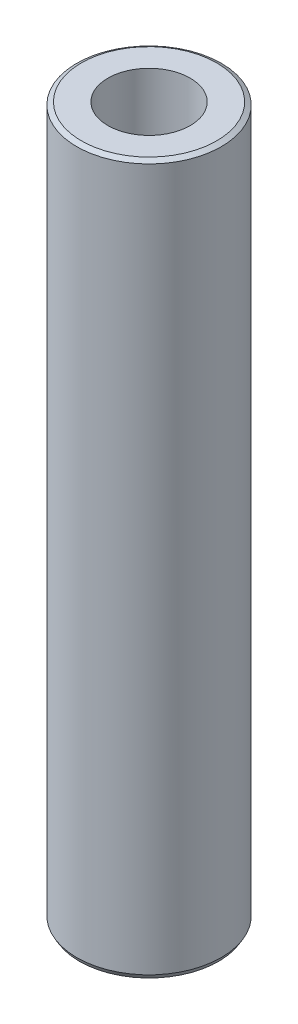
ISO-10303-21;
HEADER;
FILE_DESCRIPTION(('STEP AP214'),'2;1');
FILE_NAME('part.step','',(''),(''),'','','');
FILE_SCHEMA(('AUTOMOTIVE_DESIGN { 1 0 10303 214 1 1 1 1 }'));
ENDSEC;
DATA;
#1=APPLICATION_CONTEXT('core data for automotive mechanical design processes');
#2=APPLICATION_PROTOCOL_DEFINITION('international standard','automotive_design',2000,#1);
#3=PRODUCT_CONTEXT('',#1,'mechanical');
#4=PRODUCT('Part','Part','',(#3));
#5=PRODUCT_RELATED_PRODUCT_CATEGORY('part','',(#4));
#6=PRODUCT_DEFINITION_FORMATION('','',#4);
#7=PRODUCT_DEFINITION_CONTEXT('part definition',#1,'design');
#8=PRODUCT_DEFINITION('design','',#6,#7);
#9=PRODUCT_DEFINITION_SHAPE('','',#8);
#10=(LENGTH_UNIT() NAMED_UNIT(*) SI_UNIT(.MILLI.,.METRE.));
#11=(NAMED_UNIT(*) PLANE_ANGLE_UNIT() SI_UNIT($,.RADIAN.));
#12=(NAMED_UNIT(*) SI_UNIT($,.STERADIAN.) SOLID_ANGLE_UNIT());
#13=UNCERTAINTY_MEASURE_WITH_UNIT(LENGTH_MEASURE(1.E-05),#10,'distance_accuracy_value','');
#14=(GEOMETRIC_REPRESENTATION_CONTEXT(3) GLOBAL_UNCERTAINTY_ASSIGNED_CONTEXT((#13)) GLOBAL_UNIT_ASSIGNED_CONTEXT((#10,
#11,#12)) REPRESENTATION_CONTEXT('',''));
#15=CARTESIAN_POINT('',(0.,0.,0.));
#16=DIRECTION('',(0.,0.,1.));
#17=DIRECTION('',(1.,0.,0.));
#18=AXIS2_PLACEMENT_3D('',#15,#16,#17);
#19=CARTESIAN_POINT('',(0.,490.777688378115,0.));
#20=DIRECTION('',(0.,-1.,0.));
#21=DIRECTION('',(0.,0.,-1.));
#22=AXIS2_PLACEMENT_3D('',#19,#20,#21);
#23=CYLINDRICAL_SURFACE('',#22,50.);
#24=CARTESIAN_POINT('',(0.,488.915262984314,0.));
#25=DIRECTION('',(0.,1.,0.));
#26=DIRECTION('',(0.,0.,1.));
#27=AXIS2_PLACEMENT_3D('',#24,#25,#26);
#28=CIRCLE('',#27,50.);
#29=CARTESIAN_POINT('',(0.,488.915262984314,-50.));
#30=VERTEX_POINT('',#29);
#31=EDGE_CURVE('E50',#30,#30,#28,.F.);
#32=ORIENTED_EDGE('',*,*,#31,.T.);
#33=EDGE_LOOP('',(#32));
#34=FACE_BOUND('',#33,.T.);
#35=CARTESIAN_POINT('',(0.,3.2258154073696,0.));
#36=DIRECTION('',(0.,1.,0.));
#37=DIRECTION('',(0.,0.,1.));
#38=AXIS2_PLACEMENT_3D('',#35,#36,#37);
#39=CIRCLE('',#38,50.);
#40=CARTESIAN_POINT('',(0.,3.2258154073696,50.));
#41=VERTEX_POINT('',#40);
#42=EDGE_CURVE('E51',#41,#41,#39,.T.);
#43=ORIENTED_EDGE('',*,*,#42,.T.);
#44=EDGE_LOOP('',(#43));
#45=FACE_BOUND('',#44,.T.);
#46=ADVANCED_FACE('F39',(#34,#45),#23,.T.);
#47=CARTESIAN_POINT('',(0.,490.777688378115,0.));
#48=DIRECTION('',(0.,1.,0.));
#49=DIRECTION('',(0.,0.,1.));
#50=AXIS2_PLACEMENT_3D('',#47,#48,#49);
#51=PLANE('',#50);
#52=CARTESIAN_POINT('',(0.,490.777688378115,0.));
#53=DIRECTION('',(0.,1.,0.));
#54=DIRECTION('',(0.,0.,1.));
#55=AXIS2_PLACEMENT_3D('',#52,#53,#54);
#56=CIRCLE('',#55,46.7741845926306);
#57=CARTESIAN_POINT('',(0.,490.777688378115,-46.7741845926307));
#58=VERTEX_POINT('',#57);
#59=EDGE_CURVE('E54',#58,#58,#56,.T.);
#60=ORIENTED_EDGE('',*,*,#59,.T.);
#61=EDGE_LOOP('',(#60));
#62=FACE_BOUND('',#61,.T.);
#63=CARTESIAN_POINT('',(0.,490.777688378115,0.));
#64=DIRECTION('',(0.,1.,0.));
#65=DIRECTION('',(0.,0.,1.));
#66=AXIS2_PLACEMENT_3D('',#63,#64,#65);
#67=CIRCLE('',#66,28.4618590678295);
#68=CARTESIAN_POINT('',(0.,490.777688378115,28.4618590678295));
#69=VERTEX_POINT('',#68);
#70=EDGE_CURVE('E58',#69,#69,#67,.T.);
#71=ORIENTED_EDGE('',*,*,#70,.F.);
#72=EDGE_LOOP('',(#71));
#73=FACE_BOUND('',#72,.T.);
#74=ADVANCED_FACE('F69',(#62,#73),#51,.T.);
#75=CARTESIAN_POINT('',(0.,0.,0.));
#76=DIRECTION('',(0.,1.,0.));
#77=DIRECTION('',(0.,0.,1.));
#78=AXIS2_PLACEMENT_3D('',#75,#76,#77);
#79=PLANE('',#78);
#80=CARTESIAN_POINT('',(0.,0.,0.));
#81=DIRECTION('',(0.,1.,0.));
#82=DIRECTION('',(0.,0.,1.));
#83=AXIS2_PLACEMENT_3D('',#80,#81,#82);
#84=CIRCLE('',#83,48.1375746061991);
#85=CARTESIAN_POINT('',(0.,0.,48.1375746061991));
#86=VERTEX_POINT('',#85);
#87=EDGE_CURVE('E10',#86,#86,#84,.F.);
#88=ORIENTED_EDGE('',*,*,#87,.T.);
#89=EDGE_LOOP('',(#88));
#90=FACE_BOUND('',#89,.T.);
#91=CARTESIAN_POINT('',(0.,0.,0.));
#92=DIRECTION('',(0.,1.,0.));
#93=DIRECTION('',(0.,0.,1.));
#94=AXIS2_PLACEMENT_3D('',#91,#92,#93);
#95=CIRCLE('',#94,28.4618590678295);
#96=CARTESIAN_POINT('',(0.,0.,28.4618590678295));
#97=VERTEX_POINT('',#96);
#98=EDGE_CURVE('E63',#97,#97,#95,.T.);
#99=ORIENTED_EDGE('',*,*,#98,.T.);
#100=EDGE_LOOP('',(#99));
#101=FACE_BOUND('',#100,.T.);
#102=ADVANCED_FACE('F75',(#90,#101),#79,.F.);
#103=CARTESIAN_POINT('',(0.,490.777688378115,0.));
#104=DIRECTION('',(0.,-1.,0.));
#105=DIRECTION('',(0.,0.,-1.));
#106=AXIS2_PLACEMENT_3D('',#103,#104,#105);
#107=CYLINDRICAL_SURFACE('',#106,28.4618590678295);
#108=ORIENTED_EDGE('',*,*,#70,.T.);
#109=EDGE_LOOP('',(#108));
#110=FACE_BOUND('',#109,.T.);
#111=ORIENTED_EDGE('',*,*,#98,.F.);
#112=EDGE_LOOP('',(#111));
#113=FACE_BOUND('',#112,.T.);
#114=ADVANCED_FACE('F70',(#110,#113),#107,.F.);
#115=CARTESIAN_POINT('',(0.,490.777688378115,0.));
#116=DIRECTION('',(0.,-1.,0.));
#117=DIRECTION('',(0.,0.,-1.));
#118=AXIS2_PLACEMENT_3D('',#115,#116,#117);
#119=CONICAL_SURFACE('',#118,46.7741845926306,1.04719755119658);
#120=CARTESIAN_POINT('',(0.,488.915262984314,-50.));
#121=CARTESIAN_POINT('',(0.,488.934663248833,-49.9663977561733));
#122=CARTESIAN_POINT('',(0.,488.954063513352,-49.9327955123465));
#123=CARTESIAN_POINT('',(0.,488.992864042389,-49.865591024693));
#124=CARTESIAN_POINT('',(0.,489.012264306908,-49.8319887808662));
#125=CARTESIAN_POINT('',(0.,489.051064835945,-49.7647842932127));
#126=CARTESIAN_POINT('',(0.,489.070465100464,-49.7311820493859));
#127=CARTESIAN_POINT('',(0.,489.109265629502,-49.6639775617324));
#128=CARTESIAN_POINT('',(0.,489.128665894021,-49.6303753179056));
#129=CARTESIAN_POINT('',(0.,489.167466423058,-49.5631708302521));
#130=CARTESIAN_POINT('',(0.,489.186866687577,-49.5295685864253));
#131=CARTESIAN_POINT('',(0.,489.225667216614,-49.4623640987718));
#132=CARTESIAN_POINT('',(0.,489.245067481133,-49.4287618549451));
#133=CARTESIAN_POINT('',(0.,489.283868010171,-49.3615573672915));
#134=CARTESIAN_POINT('',(0.,489.303268274689,-49.3279551234648));
#135=CARTESIAN_POINT('',(0.,489.342068803727,-49.2607506358112));
#136=CARTESIAN_POINT('',(0.,489.361469068246,-49.2271483919845));
#137=CARTESIAN_POINT('',(0.,489.400269597283,-49.1599439043309));
#138=CARTESIAN_POINT('',(0.,489.419669861802,-49.1263416605042));
#139=CARTESIAN_POINT('',(0.,489.458470390839,-49.0591371728506));
#140=CARTESIAN_POINT('',(0.,489.477870655358,-49.0255349290239));
#141=CARTESIAN_POINT('',(0.,489.516671184396,-48.9583304413704));
#142=CARTESIAN_POINT('',(0.,489.536071448914,-48.9247281975436));
#143=CARTESIAN_POINT('',(0.,489.574871977952,-48.8575237098901));
#144=CARTESIAN_POINT('',(0.,489.594272242471,-48.8239214660633));
#145=CARTESIAN_POINT('',(0.,489.633072771508,-48.7567169784098));
#146=CARTESIAN_POINT('',(0.,489.652473036027,-48.723114734583));
#147=CARTESIAN_POINT('',(0.,489.691273565064,-48.6559102469295));
#148=CARTESIAN_POINT('',(0.,489.710673829583,-48.6223080031027));
#149=CARTESIAN_POINT('',(0.,489.749474358621,-48.5551035154492));
#150=CARTESIAN_POINT('',(0.,489.768874623139,-48.5215012716224));
#151=CARTESIAN_POINT('',(0.,489.807675152177,-48.4542967839689));
#152=CARTESIAN_POINT('',(0.,489.827075416696,-48.4206945401421));
#153=CARTESIAN_POINT('',(0.,489.865875945733,-48.3534900524886));
#154=CARTESIAN_POINT('',(0.,489.885276210252,-48.3198878086618));
#155=CARTESIAN_POINT('',(0.,489.92407673929,-48.2526833210083));
#156=CARTESIAN_POINT('',(0.,489.943477003808,-48.2190810771815));
#157=CARTESIAN_POINT('',(0.,489.982277532846,-48.151876589528));
#158=CARTESIAN_POINT('',(0.,490.001677797365,-48.1182743457012));
#159=CARTESIAN_POINT('',(0.,490.040478326402,-48.0510698580477));
#160=CARTESIAN_POINT('',(0.,490.059878590921,-48.0174676142209));
#161=CARTESIAN_POINT('',(0.,490.098679119958,-47.9502631265674));
#162=CARTESIAN_POINT('',(0.,490.118079384477,-47.9166608827407));
#163=CARTESIAN_POINT('',(0.,490.156879913515,-47.8494563950871));
#164=CARTESIAN_POINT('',(0.,490.176280178033,-47.8158541512604));
#165=CARTESIAN_POINT('',(0.,490.215080707071,-47.7486496636068));
#166=CARTESIAN_POINT('',(0.,490.23448097159,-47.7150474197801));
#167=CARTESIAN_POINT('',(0.,490.273281500627,-47.6478429321265));
#168=CARTESIAN_POINT('',(0.,490.292681765146,-47.6142406882998));
#169=CARTESIAN_POINT('',(0.,490.331482294184,-47.5470362006462));
#170=CARTESIAN_POINT('',(0.,490.350882558702,-47.5134339568195));
#171=CARTESIAN_POINT('',(0.,490.38968308774,-47.4462294691659));
#172=CARTESIAN_POINT('',(0.,490.409083352259,-47.4126272253392));
#173=CARTESIAN_POINT('',(0.,490.447883881296,-47.3454227376856));
#174=CARTESIAN_POINT('',(0.,490.467284145815,-47.3118204938589));
#175=CARTESIAN_POINT('',(0.,490.506084674852,-47.2446160062054));
#176=CARTESIAN_POINT('',(0.,490.525484939371,-47.2110137623786));
#177=CARTESIAN_POINT('',(0.,490.564285468409,-47.1438092747251));
#178=CARTESIAN_POINT('',(0.,490.583685732927,-47.1102070308983));
#179=CARTESIAN_POINT('',(0.,490.622486261965,-47.0430025432448));
#180=CARTESIAN_POINT('',(0.,490.641886526484,-47.009400299418));
#181=CARTESIAN_POINT('',(0.,490.680687055521,-46.9421958117645));
#182=CARTESIAN_POINT('',(0.,490.70008732004,-46.9085935679377));
#183=CARTESIAN_POINT('',(0.,490.738887849077,-46.8413890802842));
#184=CARTESIAN_POINT('',(0.,490.758288113596,-46.8077868364574));
#185=CARTESIAN_POINT('',(0.,490.777688378115,-46.7741845926307));
#186=B_SPLINE_CURVE_WITH_KNOTS('',3,(#120,#121,#122,#123,#124,#125,#126,#127,#128,#129,#130,
#131,#132,#133,#134,#135,#136,#137,#138,#139,#140,#141,#142,#143,#144,#145,#146,#147,#148,#149,
#150,#151,#152,#153,#154,#155,#156,#157,#158,#159,#160,#161,#162,#163,#164,#165,#166,#167,#168,
#169,#170,#171,#172,#173,#174,#175,#176,#177,#178,#179,#180,#181,#182,#183,#184,#185),
.UNSPECIFIED.,.F.,.F.,(4,2,2,2,2,2,2,2,2,2,2,2,2,2,2,2,2,2,2,2,2,2,2,2,2,2,2,2,2,2,2,2,4),(0.,
0.116401587112526,0.23280317422508,0.349204761337629,0.465606348450183,0.582007935562737,
0.698409522675291,0.814811109787817,0.931212696900371,1.04761428401292,1.16401587112547,
1.28041745823803,1.39681904535058,1.51322063246311,1.62962221957566,1.74602380668821,
1.86242539380076,1.97882698091332,2.09522856802587,2.21163015513842,2.32803174225095,
2.4444333293635,2.56083491647606,2.67723650358861,2.79363809070116,2.91003967781371,
3.02644126492624,3.14284285203879,3.25924443915135,3.3756460262639,3.49204761337645,
3.608449200489,3.72485078760156),.UNSPECIFIED.);
#187=EDGE_CURVE('BSEAM81',#30,#58,#186,.T.);
#188=ORIENTED_EDGE('',*,*,#31,.F.);
#189=ORIENTED_EDGE('',*,*,#59,.F.);
#190=ORIENTED_EDGE('',*,*,#187,.T.);
#191=ORIENTED_EDGE('',*,*,#187,.F.);
#192=EDGE_LOOP('',(#188,#190,#189,#191));
#193=FACE_BOUND('',#192,.T.);
#194=ADVANCED_FACE('F81',(#193),#119,.T.);
#195=CARTESIAN_POINT('',(0.,3.2258154073696,0.));
#196=DIRECTION('',(0.,1.,0.));
#197=DIRECTION('',(0.,0.,1.));
#198=AXIS2_PLACEMENT_3D('',#195,#196,#197);
#199=CONICAL_SURFACE('',#198,50.,0.523598775598295);
#200=ORIENTED_EDGE('',*,*,#87,.F.);
#201=EDGE_LOOP('',(#200));
#202=FACE_BOUND('',#201,.T.);
#203=ORIENTED_EDGE('',*,*,#42,.F.);
#204=EDGE_LOOP('',(#203));
#205=FACE_BOUND('',#204,.T.);
#206=ADVANCED_FACE('F45',(#202,#205),#199,.T.);
#207=CLOSED_SHELL('',(#46,#74,#102,#114,#194,#206));
#208=MANIFOLD_SOLID_BREP('B2',#207);
#209=ADVANCED_BREP_SHAPE_REPRESENTATION('',(#18,#208),#14);
#210=SHAPE_DEFINITION_REPRESENTATION(#9,#209);
ENDSEC;
END-ISO-10303-21;
